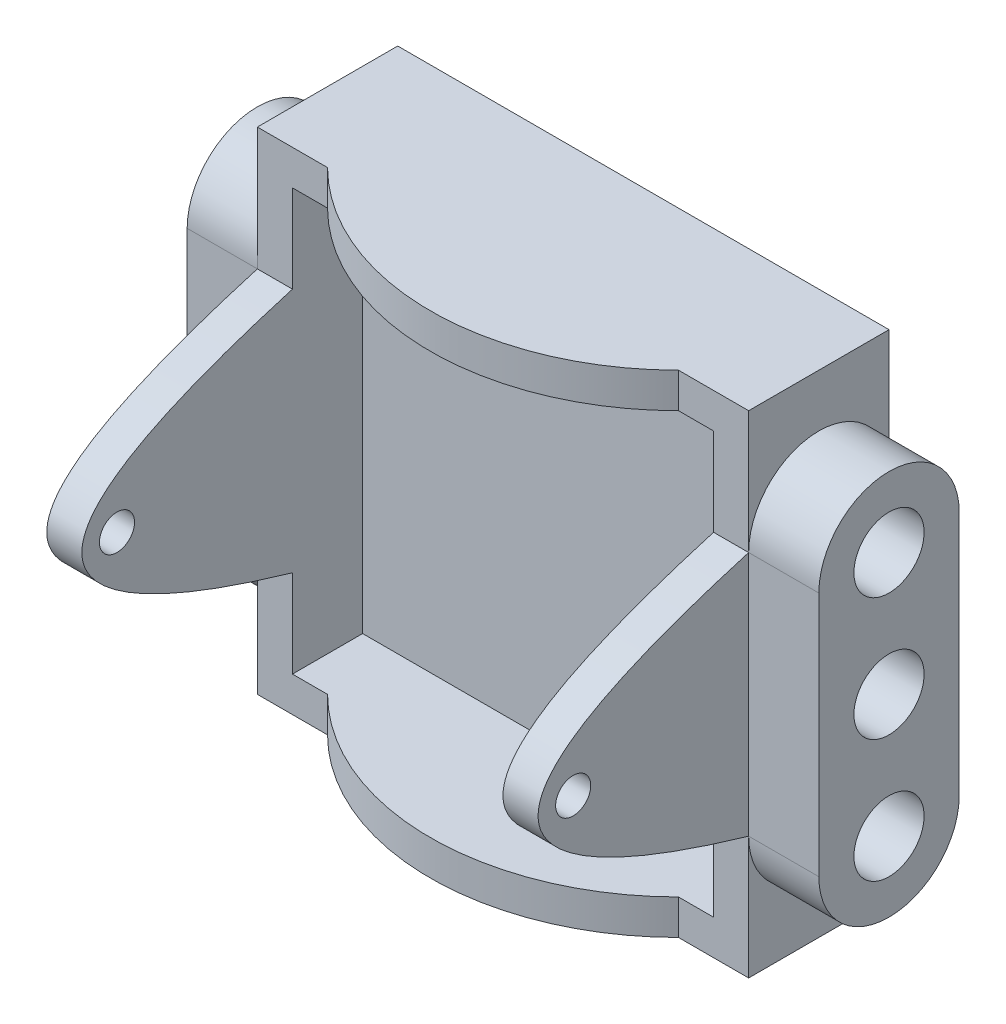
ISO-10303-21;
HEADER;
FILE_DESCRIPTION(('STEP AP214'),'2;1');
FILE_NAME('part.step','',(''),(''),'','','');
FILE_SCHEMA(('AUTOMOTIVE_DESIGN { 1 0 10303 214 1 1 1 1 }'));
ENDSEC;
DATA;
#1=APPLICATION_CONTEXT('core data for automotive mechanical design processes');
#2=APPLICATION_PROTOCOL_DEFINITION('international standard','automotive_design',2000,#1);
#3=PRODUCT_CONTEXT('',#1,'mechanical');
#4=PRODUCT('Part','Part','',(#3));
#5=PRODUCT_RELATED_PRODUCT_CATEGORY('part','',(#4));
#6=PRODUCT_DEFINITION_FORMATION('','',#4);
#7=PRODUCT_DEFINITION_CONTEXT('part definition',#1,'design');
#8=PRODUCT_DEFINITION('design','',#6,#7);
#9=PRODUCT_DEFINITION_SHAPE('','',#8);
#10=(LENGTH_UNIT() NAMED_UNIT(*) SI_UNIT(.MILLI.,.METRE.));
#11=(NAMED_UNIT(*) PLANE_ANGLE_UNIT() SI_UNIT($,.RADIAN.));
#12=(NAMED_UNIT(*) SI_UNIT($,.STERADIAN.) SOLID_ANGLE_UNIT());
#13=UNCERTAINTY_MEASURE_WITH_UNIT(LENGTH_MEASURE(1.E-05),#10,'distance_accuracy_value','');
#14=(GEOMETRIC_REPRESENTATION_CONTEXT(3) GLOBAL_UNCERTAINTY_ASSIGNED_CONTEXT((#13)) GLOBAL_UNIT_ASSIGNED_CONTEXT((#10,
#11,#12)) REPRESENTATION_CONTEXT('',''));
#15=CARTESIAN_POINT('',(0.,0.,0.));
#16=DIRECTION('',(0.,0.,1.));
#17=DIRECTION('',(1.,0.,0.));
#18=AXIS2_PLACEMENT_3D('',#15,#16,#17);
#19=CARTESIAN_POINT('',(9.525,-9.525,3.175));
#20=DIRECTION('',(1.,0.,0.));
#21=DIRECTION('',(0.,0.,-1.));
#22=AXIS2_PLACEMENT_3D('',#19,#20,#21);
#23=PLANE('',#22);
#24=CARTESIAN_POINT('',(9.525,-5.55625,6.35));
#25=CARTESIAN_POINT('',(9.525,0.,25.4));
#26=CARTESIAN_POINT('',(9.525,5.55625,6.35));
#27=B_SPLINE_CURVE_WITH_KNOTS('',2,(#24,#25,#26),.UNSPECIFIED.,.F.,.F.,(3,3),(0.,1.),.UNSPECIFIED.);
#28=CARTESIAN_POINT('',(9.525,5.55625,6.34999999999999));
#29=VERTEX_POINT('',#28);
#30=CARTESIAN_POINT('',(9.525,-5.55625,6.35));
#31=VERTEX_POINT('',#30);
#32=EDGE_CURVE('E509',#29,#31,#27,.F.);
#33=ORIENTED_EDGE('',*,*,#32,.F.);
#34=DIRECTION('',(0.,-1.,0.));
#35=VECTOR('',#34,1.);
#36=CARTESIAN_POINT('',(9.525,0.,6.34999999999999));
#37=LINE('',#36,#35);
#38=CARTESIAN_POINT('',(9.525,9.525,6.35));
#39=VERTEX_POINT('',#38);
#40=EDGE_CURVE('E501',#39,#29,#37,.T.);
#41=ORIENTED_EDGE('',*,*,#40,.F.);
#42=DIRECTION('',(0.,0.,1.));
#43=VECTOR('',#42,1.);
#44=CARTESIAN_POINT('',(9.525,9.525,3.175));
#45=LINE('',#44,#43);
#46=CARTESIAN_POINT('',(9.525,9.525,3.175));
#47=VERTEX_POINT('',#46);
#48=EDGE_CURVE('E506',#47,#39,#45,.T.);
#49=ORIENTED_EDGE('',*,*,#48,.F.);
#50=DIRECTION('',(0.,1.,0.));
#51=VECTOR('',#50,1.);
#52=CARTESIAN_POINT('',(9.525,-9.525,3.175));
#53=LINE('',#52,#51);
#54=CARTESIAN_POINT('',(9.525,-9.525,3.175));
#55=VERTEX_POINT('',#54);
#56=EDGE_CURVE('E576',#55,#47,#53,.T.);
#57=ORIENTED_EDGE('',*,*,#56,.F.);
#58=DIRECTION('',(0.,0.,1.));
#59=VECTOR('',#58,1.);
#60=CARTESIAN_POINT('',(9.525,-9.525,3.175));
#61=LINE('',#60,#59);
#62=CARTESIAN_POINT('',(9.525,-9.525,6.35));
#63=VERTEX_POINT('',#62);
#64=EDGE_CURVE('E546',#55,#63,#61,.T.);
#65=ORIENTED_EDGE('',*,*,#64,.T.);
#66=DIRECTION('',(0.,1.,0.));
#67=VECTOR('',#66,1.);
#68=CARTESIAN_POINT('',(9.525,0.,6.35));
#69=LINE('',#68,#67);
#70=EDGE_CURVE('E594',#63,#31,#69,.T.);
#71=ORIENTED_EDGE('',*,*,#70,.T.);
#72=EDGE_LOOP('',(#33,#41,#49,#57,#65,#71));
#73=FACE_BOUND('',#72,.T.);
#74=CARTESIAN_POINT('',(9.525,0.,14.2875));
#75=DIRECTION('',(1.,0.,0.));
#76=DIRECTION('',(0.,0.,-1.));
#77=AXIS2_PLACEMENT_3D('',#74,#75,#76);
#78=CIRCLE('',#77,0.793749999999999);
#79=CARTESIAN_POINT('',(9.525,0.,13.49375));
#80=VERTEX_POINT('',#79);
#81=EDGE_CURVE('E932',#80,#80,#78,.T.);
#82=ORIENTED_EDGE('',*,*,#81,.T.);
#83=EDGE_LOOP('',(#82));
#84=FACE_BOUND('',#83,.T.);
#85=ADVANCED_FACE('F351',(#73,#84),#23,.F.);
#86=CARTESIAN_POINT('',(11.1125,0.,0.));
#87=DIRECTION('',(1.,0.,0.));
#88=DIRECTION('',(0.,0.,1.));
#89=AXIS2_PLACEMENT_3D('',#86,#87,#88);
#90=PLANE('',#89);
#91=DIRECTION('',(0.,1.,0.));
#92=VECTOR('',#91,1.);
#93=CARTESIAN_POINT('',(11.1125,0.,6.35));
#94=LINE('',#93,#92);
#95=CARTESIAN_POINT('',(11.1125,-5.55625,6.35));
#96=VERTEX_POINT('',#95);
#97=CARTESIAN_POINT('',(11.1125,5.55625,6.35));
#98=VERTEX_POINT('',#97);
#99=EDGE_CURVE('E733',#96,#98,#94,.T.);
#100=ORIENTED_EDGE('',*,*,#99,.T.);
#101=CARTESIAN_POINT('',(11.1125,-5.55625,6.35));
#102=CARTESIAN_POINT('',(11.1125,0.,25.4));
#103=CARTESIAN_POINT('',(11.1125,5.55625,6.35));
#104=B_SPLINE_CURVE_WITH_KNOTS('',2,(#101,#102,#103),.UNSPECIFIED.,.F.,.F.,(3,3),(0.,1.),.UNSPECIFIED.);
#105=EDGE_CURVE('E602',#96,#98,#104,.T.);
#106=ORIENTED_EDGE('',*,*,#105,.F.);
#107=EDGE_LOOP('',(#100,#106));
#108=FACE_BOUND('',#107,.T.);
#109=CARTESIAN_POINT('',(11.1125,0.,14.2875));
#110=DIRECTION('',(-1.,0.,0.));
#111=DIRECTION('',(0.,0.,1.));
#112=AXIS2_PLACEMENT_3D('',#109,#110,#111);
#113=CIRCLE('',#112,0.793749999999999);
#114=CARTESIAN_POINT('',(11.1125,0.,15.08125));
#115=VERTEX_POINT('',#114);
#116=EDGE_CURVE('E515',#115,#115,#113,.T.);
#117=ORIENTED_EDGE('',*,*,#116,.T.);
#118=EDGE_LOOP('',(#117));
#119=FACE_BOUND('',#118,.T.);
#120=ADVANCED_FACE('F922',(#108,#119),#90,.T.);
#121=CARTESIAN_POINT('',(-14.2875,-11.1125,15.875));
#122=DIRECTION('',(0.,1.,0.));
#123=DIRECTION('',(0.,0.,1.));
#124=AXIS2_PLACEMENT_3D('',#121,#122,#123);
#125=PLANE('',#124);
#126=DIRECTION('',(0.,0.,1.));
#127=VECTOR('',#126,1.);
#128=CARTESIAN_POINT('',(11.1125,-11.1125,0.));
#129=LINE('',#128,#127);
#130=CARTESIAN_POINT('',(11.1125,-11.1125,0.));
#131=VERTEX_POINT('',#130);
#132=CARTESIAN_POINT('',(11.1125,-11.1125,6.35));
#133=VERTEX_POINT('',#132);
#134=EDGE_CURVE('E725',#131,#133,#129,.T.);
#135=ORIENTED_EDGE('',*,*,#134,.T.);
#136=DIRECTION('',(-1.,0.,0.));
#137=VECTOR('',#136,1.);
#138=CARTESIAN_POINT('',(0.,-11.1125,6.35));
#139=LINE('',#138,#137);
#140=CARTESIAN_POINT('',(7.9375,-11.1125,6.35));
#141=VERTEX_POINT('',#140);
#142=EDGE_CURVE('E659',#133,#141,#139,.T.);
#143=ORIENTED_EDGE('',*,*,#142,.T.);
#144=CARTESIAN_POINT('',(0.,-11.1125,-1.58749999999998));
#145=DIRECTION('',(0.,1.,0.));
#146=DIRECTION('',(0.,0.,1.));
#147=AXIS2_PLACEMENT_3D('',#144,#145,#146);
#148=CIRCLE('',#147,11.2253201513364);
#149=CARTESIAN_POINT('',(-7.9375,-11.1125,6.35));
#150=VERTEX_POINT('',#149);
#151=EDGE_CURVE('E649',#150,#141,#148,.T.);
#152=ORIENTED_EDGE('',*,*,#151,.F.);
#153=DIRECTION('',(1.,0.,0.));
#154=VECTOR('',#153,1.);
#155=CARTESIAN_POINT('',(0.,-11.1125,6.35));
#156=LINE('',#155,#154);
#157=CARTESIAN_POINT('',(-11.1125,-11.1125,6.35));
#158=VERTEX_POINT('',#157);
#159=EDGE_CURVE('E655',#158,#150,#156,.T.);
#160=ORIENTED_EDGE('',*,*,#159,.F.);
#161=DIRECTION('',(0.,0.,1.));
#162=VECTOR('',#161,1.);
#163=CARTESIAN_POINT('',(-11.1125,-11.1125,0.));
#164=LINE('',#163,#162);
#165=CARTESIAN_POINT('',(-11.1125,-11.1125,0.));
#166=VERTEX_POINT('',#165);
#167=EDGE_CURVE('E799',#166,#158,#164,.T.);
#168=ORIENTED_EDGE('',*,*,#167,.F.);
#169=DIRECTION('',(1.,0.,0.));
#170=VECTOR('',#169,1.);
#171=CARTESIAN_POINT('',(-14.2875,-11.1125,0.));
#172=LINE('',#171,#170);
#173=EDGE_CURVE('E554',#166,#131,#172,.T.);
#174=ORIENTED_EDGE('',*,*,#173,.T.);
#175=EDGE_LOOP('',(#135,#143,#152,#160,#168,#174));
#176=FACE_BOUND('',#175,.T.);
#177=ADVANCED_FACE('F925',(#176),#125,.F.);
#178=CARTESIAN_POINT('',(11.1125,-5.55625,3.175));
#179=DIRECTION('',(-1.,0.,0.));
#180=DIRECTION('',(0.,0.,1.));
#181=AXIS2_PLACEMENT_3D('',#178,#179,#180);
#182=CIRCLE('',#181,3.175);
#183=CARTESIAN_POINT('',(11.1125,-5.55625,0.));
#184=VERTEX_POINT('',#183);
#185=EDGE_CURVE('E729',#184,#96,#182,.T.);
#186=ORIENTED_EDGE('',*,*,#185,.T.);
#187=DIRECTION('',(0.,-1.,0.));
#188=VECTOR('',#187,1.);
#189=CARTESIAN_POINT('',(11.1125,0.,6.35));
#190=LINE('',#189,#188);
#191=EDGE_CURVE('E898',#96,#133,#190,.T.);
#192=ORIENTED_EDGE('',*,*,#191,.T.);
#193=ORIENTED_EDGE('',*,*,#134,.F.);
#194=DIRECTION('',(0.,-1.,0.));
#195=VECTOR('',#194,1.);
#196=CARTESIAN_POINT('',(11.1125,0.,0.));
#197=LINE('',#196,#195);
#198=EDGE_CURVE('E722',#184,#131,#197,.T.);
#199=ORIENTED_EDGE('',*,*,#198,.F.);
#200=EDGE_LOOP('',(#186,#192,#193,#199));
#201=FACE_BOUND('',#200,.T.);
#202=ADVANCED_FACE('F927',(#201),#90,.T.);
#203=CARTESIAN_POINT('',(-9.525,-9.525,3.175));
#204=DIRECTION('',(-1.,0.,0.));
#205=DIRECTION('',(0.,0.,1.));
#206=AXIS2_PLACEMENT_3D('',#203,#204,#205);
#207=PLANE('',#206);
#208=CARTESIAN_POINT('',(-9.525,0.,14.2875));
#209=DIRECTION('',(-1.,0.,0.));
#210=DIRECTION('',(0.,0.,1.));
#211=AXIS2_PLACEMENT_3D('',#208,#209,#210);
#212=CIRCLE('',#211,0.793749999999999);
#213=CARTESIAN_POINT('',(-9.525,0.,15.08125));
#214=VERTEX_POINT('',#213);
#215=EDGE_CURVE('E889',#214,#214,#212,.F.);
#216=ORIENTED_EDGE('',*,*,#215,.F.);
#217=EDGE_LOOP('',(#216));
#218=FACE_BOUND('',#217,.T.);
#219=CARTESIAN_POINT('',(-9.525,-5.55625,6.35));
#220=CARTESIAN_POINT('',(-9.525,0.,25.4));
#221=CARTESIAN_POINT('',(-9.525,5.55625,6.35));
#222=B_SPLINE_CURVE_WITH_KNOTS('',2,(#219,#220,#221),.UNSPECIFIED.,.F.,.F.,(3,3),(0.,1.),.UNSPECIFIED.);
#223=CARTESIAN_POINT('',(-9.525,5.55625,6.35));
#224=VERTEX_POINT('',#223);
#225=CARTESIAN_POINT('',(-9.525,-5.55625,6.35));
#226=VERTEX_POINT('',#225);
#227=EDGE_CURVE('E859',#224,#226,#222,.F.);
#228=ORIENTED_EDGE('',*,*,#227,.T.);
#229=DIRECTION('',(0.,1.,0.));
#230=VECTOR('',#229,1.);
#231=CARTESIAN_POINT('',(-9.52499999999999,-11.1125,6.35));
#232=LINE('',#231,#230);
#233=CARTESIAN_POINT('',(-9.52499999999999,-9.525,6.35));
#234=VERTEX_POINT('',#233);
#235=EDGE_CURVE('E882',#234,#226,#232,.T.);
#236=ORIENTED_EDGE('',*,*,#235,.F.);
#237=DIRECTION('',(0.,0.,1.));
#238=VECTOR('',#237,1.);
#239=CARTESIAN_POINT('',(-9.525,-9.525,3.175));
#240=LINE('',#239,#238);
#241=CARTESIAN_POINT('',(-9.525,-9.525,3.175));
#242=VERTEX_POINT('',#241);
#243=EDGE_CURVE('E534',#242,#234,#240,.T.);
#244=ORIENTED_EDGE('',*,*,#243,.F.);
#245=DIRECTION('',(0.,-1.,0.));
#246=VECTOR('',#245,1.);
#247=CARTESIAN_POINT('',(-9.525,-9.525,3.175));
#248=LINE('',#247,#246);
#249=CARTESIAN_POINT('',(-9.525,9.525,3.175));
#250=VERTEX_POINT('',#249);
#251=EDGE_CURVE('E537',#250,#242,#248,.T.);
#252=ORIENTED_EDGE('',*,*,#251,.F.);
#253=DIRECTION('',(0.,0.,1.));
#254=VECTOR('',#253,1.);
#255=CARTESIAN_POINT('',(-9.525,9.525,3.175));
#256=LINE('',#255,#254);
#257=CARTESIAN_POINT('',(-9.525,9.525,6.35));
#258=VERTEX_POINT('',#257);
#259=EDGE_CURVE('E528',#250,#258,#256,.T.);
#260=ORIENTED_EDGE('',*,*,#259,.T.);
#261=DIRECTION('',(0.,-1.,0.));
#262=VECTOR('',#261,1.);
#263=CARTESIAN_POINT('',(-9.525,0.,6.34999999999999));
#264=LINE('',#263,#262);
#265=EDGE_CURVE('E375',#258,#224,#264,.T.);
#266=ORIENTED_EDGE('',*,*,#265,.T.);
#267=EDGE_LOOP('',(#228,#236,#244,#252,#260,#266));
#268=FACE_BOUND('',#267,.T.);
#269=ADVANCED_FACE('F568',(#218,#268),#207,.F.);
#270=CARTESIAN_POINT('',(-11.1125,0.,0.));
#271=DIRECTION('',(-1.,0.,0.));
#272=DIRECTION('',(0.,0.,1.));
#273=AXIS2_PLACEMENT_3D('',#270,#271,#272);
#274=PLANE('',#273);
#275=CARTESIAN_POINT('',(-11.1125,0.,14.2875));
#276=DIRECTION('',(-1.,0.,0.));
#277=DIRECTION('',(0.,0.,1.));
#278=AXIS2_PLACEMENT_3D('',#275,#276,#277);
#279=CIRCLE('',#278,0.793749999999999);
#280=CARTESIAN_POINT('',(-11.1125,0.,15.08125));
#281=VERTEX_POINT('',#280);
#282=EDGE_CURVE('E886',#281,#281,#279,.T.);
#283=ORIENTED_EDGE('',*,*,#282,.F.);
#284=EDGE_LOOP('',(#283));
#285=FACE_BOUND('',#284,.T.);
#286=DIRECTION('',(0.,1.,0.));
#287=VECTOR('',#286,1.);
#288=CARTESIAN_POINT('',(-11.1125,0.,6.35));
#289=LINE('',#288,#287);
#290=CARTESIAN_POINT('',(-11.1125,-5.55625,6.35));
#291=VERTEX_POINT('',#290);
#292=CARTESIAN_POINT('',(-11.1125,5.55625,6.35));
#293=VERTEX_POINT('',#292);
#294=EDGE_CURVE('E787',#291,#293,#289,.T.);
#295=ORIENTED_EDGE('',*,*,#294,.F.);
#296=CARTESIAN_POINT('',(-11.1125,-5.55625,6.35));
#297=CARTESIAN_POINT('',(-11.1125,0.,25.4));
#298=CARTESIAN_POINT('',(-11.1125,5.55625,6.35));
#299=B_SPLINE_CURVE_WITH_KNOTS('',2,(#296,#297,#298),.UNSPECIFIED.,.F.,.F.,(3,3),(0.,1.),.UNSPECIFIED.);
#300=EDGE_CURVE('E855',#291,#293,#299,.T.);
#301=ORIENTED_EDGE('',*,*,#300,.T.);
#302=EDGE_LOOP('',(#295,#301));
#303=FACE_BOUND('',#302,.T.);
#304=ADVANCED_FACE('F854',(#285,#303),#274,.T.);
#305=CARTESIAN_POINT('',(-14.2875,11.1125,15.875));
#306=DIRECTION('',(0.,-1.,0.));
#307=DIRECTION('',(0.,0.,-1.));
#308=AXIS2_PLACEMENT_3D('',#305,#306,#307);
#309=PLANE('',#308);
#310=DIRECTION('',(-1.,0.,0.));
#311=VECTOR('',#310,1.);
#312=CARTESIAN_POINT('',(0.,11.1125,6.35));
#313=LINE('',#312,#311);
#314=CARTESIAN_POINT('',(11.1125,11.1125,6.35));
#315=VERTEX_POINT('',#314);
#316=CARTESIAN_POINT('',(7.9375,11.1125,6.35));
#317=VERTEX_POINT('',#316);
#318=EDGE_CURVE('E656',#315,#317,#313,.T.);
#319=ORIENTED_EDGE('',*,*,#318,.F.);
#320=DIRECTION('',(0.,0.,-1.));
#321=VECTOR('',#320,1.);
#322=CARTESIAN_POINT('',(11.1125,11.1125,0.));
#323=LINE('',#322,#321);
#324=CARTESIAN_POINT('',(11.1125,11.1125,0.));
#325=VERTEX_POINT('',#324);
#326=EDGE_CURVE('E721',#315,#325,#323,.T.);
#327=ORIENTED_EDGE('',*,*,#326,.T.);
#328=DIRECTION('',(-1.,0.,0.));
#329=VECTOR('',#328,1.);
#330=CARTESIAN_POINT('',(-14.2875,11.1125,0.));
#331=LINE('',#330,#329);
#332=CARTESIAN_POINT('',(-11.1125,11.1125,0.));
#333=VERTEX_POINT('',#332);
#334=EDGE_CURVE('E545',#325,#333,#331,.T.);
#335=ORIENTED_EDGE('',*,*,#334,.T.);
#336=DIRECTION('',(0.,0.,-1.));
#337=VECTOR('',#336,1.);
#338=CARTESIAN_POINT('',(-11.1125,11.1125,0.));
#339=LINE('',#338,#337);
#340=CARTESIAN_POINT('',(-11.1125,11.1125,6.35));
#341=VERTEX_POINT('',#340);
#342=EDGE_CURVE('E804',#341,#333,#339,.T.);
#343=ORIENTED_EDGE('',*,*,#342,.F.);
#344=DIRECTION('',(1.,0.,0.));
#345=VECTOR('',#344,1.);
#346=CARTESIAN_POINT('',(0.,11.1125,6.35));
#347=LINE('',#346,#345);
#348=CARTESIAN_POINT('',(-7.9375,11.1125,6.35));
#349=VERTEX_POINT('',#348);
#350=EDGE_CURVE('E667',#341,#349,#347,.T.);
#351=ORIENTED_EDGE('',*,*,#350,.T.);
#352=CARTESIAN_POINT('',(0.,11.1125,-1.58749999999998));
#353=DIRECTION('',(0.,1.,0.));
#354=DIRECTION('',(0.,0.,1.));
#355=AXIS2_PLACEMENT_3D('',#352,#353,#354);
#356=CIRCLE('',#355,11.2253201513364);
#357=EDGE_CURVE('E663',#349,#317,#356,.T.);
#358=ORIENTED_EDGE('',*,*,#357,.T.);
#359=EDGE_LOOP('',(#319,#327,#335,#343,#351,#358));
#360=FACE_BOUND('',#359,.T.);
#361=ADVANCED_FACE('F956',(#360),#309,.F.);
#362=DIRECTION('',(0.,-1.,0.));
#363=VECTOR('',#362,1.);
#364=CARTESIAN_POINT('',(-11.1125,0.,6.35));
#365=LINE('',#364,#363);
#366=EDGE_CURVE('E878',#291,#158,#365,.T.);
#367=ORIENTED_EDGE('',*,*,#366,.F.);
#368=CARTESIAN_POINT('',(-11.1125,-5.55625,3.175));
#369=DIRECTION('',(-1.,0.,0.));
#370=DIRECTION('',(0.,0.,1.));
#371=AXIS2_PLACEMENT_3D('',#368,#369,#370);
#372=CIRCLE('',#371,3.175);
#373=CARTESIAN_POINT('',(-11.1125,-5.55625,0.));
#374=VERTEX_POINT('',#373);
#375=EDGE_CURVE('E792',#374,#291,#372,.T.);
#376=ORIENTED_EDGE('',*,*,#375,.F.);
#377=DIRECTION('',(0.,-1.,0.));
#378=VECTOR('',#377,1.);
#379=CARTESIAN_POINT('',(-11.1125,0.,0.));
#380=LINE('',#379,#378);
#381=EDGE_CURVE('E796',#374,#166,#380,.T.);
#382=ORIENTED_EDGE('',*,*,#381,.T.);
#383=ORIENTED_EDGE('',*,*,#167,.T.);
#384=EDGE_LOOP('',(#367,#376,#382,#383));
#385=FACE_BOUND('',#384,.T.);
#386=ADVANCED_FACE('F958',(#385),#274,.T.);
#387=CARTESIAN_POINT('',(-11.1125,5.55625,3.175));
#388=DIRECTION('',(-1.,0.,0.));
#389=DIRECTION('',(0.,0.,1.));
#390=AXIS2_PLACEMENT_3D('',#387,#388,#389);
#391=CIRCLE('',#390,3.175);
#392=CARTESIAN_POINT('',(-11.1125,5.55625,0.));
#393=VERTEX_POINT('',#392);
#394=EDGE_CURVE('E784',#293,#393,#391,.T.);
#395=ORIENTED_EDGE('',*,*,#394,.F.);
#396=DIRECTION('',(0.,1.,0.));
#397=VECTOR('',#396,1.);
#398=CARTESIAN_POINT('',(-11.1125,0.,6.34999999999999));
#399=LINE('',#398,#397);
#400=EDGE_CURVE('E668',#293,#341,#399,.T.);
#401=ORIENTED_EDGE('',*,*,#400,.T.);
#402=ORIENTED_EDGE('',*,*,#342,.T.);
#403=EDGE_CURVE('E800',#333,#393,#380,.T.);
#404=ORIENTED_EDGE('',*,*,#403,.T.);
#405=EDGE_LOOP('',(#395,#401,#402,#404));
#406=FACE_BOUND('',#405,.T.);
#407=ADVANCED_FACE('F837',(#406),#274,.T.);
#408=CARTESIAN_POINT('',(0.,0.,0.));
#409=DIRECTION('',(0.,0.,-1.));
#410=DIRECTION('',(-1.,0.,0.));
#411=AXIS2_PLACEMENT_3D('',#408,#409,#410);
#412=PLANE('',#411);
#413=DIRECTION('',(1.,0.,0.));
#414=VECTOR('',#413,1.);
#415=CARTESIAN_POINT('',(11.1125,5.55625,0.));
#416=LINE('',#415,#414);
#417=CARTESIAN_POINT('',(11.1125,5.55625,0.));
#418=VERTEX_POINT('',#417);
#419=CARTESIAN_POINT('',(14.2875,5.55625,0.));
#420=VERTEX_POINT('',#419);
#421=EDGE_CURVE('E737',#418,#420,#416,.T.);
#422=ORIENTED_EDGE('',*,*,#421,.T.);
#423=DIRECTION('',(0.,1.,0.));
#424=VECTOR('',#423,1.);
#425=CARTESIAN_POINT('',(14.2875,-11.1125,0.));
#426=LINE('',#425,#424);
#427=CARTESIAN_POINT('',(14.2875,-5.55625,0.));
#428=VERTEX_POINT('',#427);
#429=EDGE_CURVE('E541',#428,#420,#426,.T.);
#430=ORIENTED_EDGE('',*,*,#429,.F.);
#431=DIRECTION('',(1.,0.,0.));
#432=VECTOR('',#431,1.);
#433=CARTESIAN_POINT('',(11.1125,-5.55625,0.));
#434=LINE('',#433,#432);
#435=EDGE_CURVE('E754',#184,#428,#434,.T.);
#436=ORIENTED_EDGE('',*,*,#435,.F.);
#437=ORIENTED_EDGE('',*,*,#198,.T.);
#438=ORIENTED_EDGE('',*,*,#173,.F.);
#439=ORIENTED_EDGE('',*,*,#381,.F.);
#440=DIRECTION('',(-1.,0.,0.));
#441=VECTOR('',#440,1.);
#442=CARTESIAN_POINT('',(-11.1125,-5.55625,0.));
#443=LINE('',#442,#441);
#444=CARTESIAN_POINT('',(-14.2875,-5.55625,0.));
#445=VERTEX_POINT('',#444);
#446=EDGE_CURVE('E819',#374,#445,#443,.T.);
#447=ORIENTED_EDGE('',*,*,#446,.T.);
#448=DIRECTION('',(0.,-1.,0.));
#449=VECTOR('',#448,1.);
#450=CARTESIAN_POINT('',(-14.2875,-11.1125,0.));
#451=LINE('',#450,#449);
#452=CARTESIAN_POINT('',(-14.2875,5.55625,0.));
#453=VERTEX_POINT('',#452);
#454=EDGE_CURVE('E550',#453,#445,#451,.T.);
#455=ORIENTED_EDGE('',*,*,#454,.F.);
#456=DIRECTION('',(-1.,0.,0.));
#457=VECTOR('',#456,1.);
#458=CARTESIAN_POINT('',(-11.1125,5.55625,0.));
#459=LINE('',#458,#457);
#460=EDGE_CURVE('E580',#393,#453,#459,.T.);
#461=ORIENTED_EDGE('',*,*,#460,.F.);
#462=ORIENTED_EDGE('',*,*,#403,.F.);
#463=ORIENTED_EDGE('',*,*,#334,.F.);
#464=EDGE_CURVE('E716',#325,#418,#197,.T.);
#465=ORIENTED_EDGE('',*,*,#464,.T.);
#466=EDGE_LOOP('',(#422,#430,#436,#437,#438,#439,#447,#455,#461,#462,#463,#465));
#467=FACE_BOUND('',#466,.T.);
#468=ADVANCED_FACE('F843',(#467),#412,.T.);
#469=CARTESIAN_POINT('',(14.2875,-11.1125,15.875));
#470=DIRECTION('',(-1.,0.,0.));
#471=DIRECTION('',(0.,0.,1.));
#472=AXIS2_PLACEMENT_3D('',#469,#470,#471);
#473=PLANE('',#472);
#474=ORIENTED_EDGE('',*,*,#429,.T.);
#475=CARTESIAN_POINT('',(14.2875,5.55625,3.175));
#476=DIRECTION('',(-1.,0.,0.));
#477=DIRECTION('',(0.,0.,1.));
#478=AXIS2_PLACEMENT_3D('',#475,#476,#477);
#479=CIRCLE('',#478,3.175);
#480=CARTESIAN_POINT('',(14.2875,5.55625,6.35));
#481=VERTEX_POINT('',#480);
#482=EDGE_CURVE('E692',#481,#420,#479,.T.);
#483=ORIENTED_EDGE('',*,*,#482,.F.);
#484=DIRECTION('',(0.,1.,0.));
#485=VECTOR('',#484,1.);
#486=CARTESIAN_POINT('',(14.2875,0.,6.35));
#487=LINE('',#486,#485);
#488=CARTESIAN_POINT('',(14.2875,-5.55625,6.35));
#489=VERTEX_POINT('',#488);
#490=EDGE_CURVE('E717',#489,#481,#487,.T.);
#491=ORIENTED_EDGE('',*,*,#490,.F.);
#492=CARTESIAN_POINT('',(14.2875,-5.55625,3.175));
#493=DIRECTION('',(-1.,0.,0.));
#494=DIRECTION('',(0.,0.,1.));
#495=AXIS2_PLACEMENT_3D('',#492,#493,#494);
#496=CIRCLE('',#495,3.175);
#497=EDGE_CURVE('E740',#428,#489,#496,.T.);
#498=ORIENTED_EDGE('',*,*,#497,.F.);
#499=EDGE_LOOP('',(#474,#483,#491,#498));
#500=FACE_BOUND('',#499,.T.);
#501=CARTESIAN_POINT('',(14.2875,5.55625,3.175));
#502=DIRECTION('',(-1.,0.,0.));
#503=DIRECTION('',(0.,0.,1.));
#504=AXIS2_PLACEMENT_3D('',#501,#502,#503);
#505=CIRCLE('',#504,1.5875);
#506=CARTESIAN_POINT('',(14.2875,5.55625,4.7625));
#507=VERTEX_POINT('',#506);
#508=EDGE_CURVE('E693',#507,#507,#505,.T.);
#509=ORIENTED_EDGE('',*,*,#508,.T.);
#510=EDGE_LOOP('',(#509));
#511=FACE_BOUND('',#510,.T.);
#512=CARTESIAN_POINT('',(14.2875,0.,3.175));
#513=DIRECTION('',(-1.,0.,0.));
#514=DIRECTION('',(0.,0.,1.));
#515=AXIS2_PLACEMENT_3D('',#512,#513,#514);
#516=CIRCLE('',#515,1.5875);
#517=CARTESIAN_POINT('',(14.2875,0.,4.7625));
#518=VERTEX_POINT('',#517);
#519=EDGE_CURVE('E701',#518,#518,#516,.T.);
#520=ORIENTED_EDGE('',*,*,#519,.T.);
#521=EDGE_LOOP('',(#520));
#522=FACE_BOUND('',#521,.T.);
#523=CARTESIAN_POINT('',(14.2875,-5.55625,3.175));
#524=DIRECTION('',(-1.,0.,0.));
#525=DIRECTION('',(0.,0.,1.));
#526=AXIS2_PLACEMENT_3D('',#523,#524,#525);
#527=CIRCLE('',#526,1.5875);
#528=CARTESIAN_POINT('',(14.2875,-5.55625,4.7625));
#529=VERTEX_POINT('',#528);
#530=EDGE_CURVE('E687',#529,#529,#527,.T.);
#531=ORIENTED_EDGE('',*,*,#530,.T.);
#532=EDGE_LOOP('',(#531));
#533=FACE_BOUND('',#532,.T.);
#534=ADVANCED_FACE('F353',(#500,#511,#522,#533),#473,.F.);
#535=CARTESIAN_POINT('',(-14.2875,-11.1125,15.875));
#536=DIRECTION('',(1.,0.,0.));
#537=DIRECTION('',(0.,0.,-1.));
#538=AXIS2_PLACEMENT_3D('',#535,#536,#537);
#539=PLANE('',#538);
#540=CARTESIAN_POINT('',(-14.2875,-5.55625,3.175));
#541=DIRECTION('',(-1.,0.,0.));
#542=DIRECTION('',(0.,0.,1.));
#543=AXIS2_PLACEMENT_3D('',#540,#541,#542);
#544=CIRCLE('',#543,1.5875);
#545=CARTESIAN_POINT('',(-14.2875,-5.55625,4.7625));
#546=VERTEX_POINT('',#545);
#547=EDGE_CURVE('E750',#546,#546,#544,.T.);
#548=ORIENTED_EDGE('',*,*,#547,.F.);
#549=EDGE_LOOP('',(#548));
#550=FACE_BOUND('',#549,.T.);
#551=CARTESIAN_POINT('',(-14.2875,0.,3.175));
#552=DIRECTION('',(-1.,0.,0.));
#553=DIRECTION('',(0.,0.,1.));
#554=AXIS2_PLACEMENT_3D('',#551,#552,#553);
#555=CIRCLE('',#554,1.5875);
#556=CARTESIAN_POINT('',(-14.2875,0.,4.7625));
#557=VERTEX_POINT('',#556);
#558=EDGE_CURVE('E773',#557,#557,#555,.T.);
#559=ORIENTED_EDGE('',*,*,#558,.F.);
#560=EDGE_LOOP('',(#559));
#561=FACE_BOUND('',#560,.T.);
#562=CARTESIAN_POINT('',(-14.2875,5.55625,3.175));
#563=DIRECTION('',(-1.,0.,0.));
#564=DIRECTION('',(0.,0.,1.));
#565=AXIS2_PLACEMENT_3D('',#562,#563,#564);
#566=CIRCLE('',#565,1.5875);
#567=CARTESIAN_POINT('',(-14.2875,5.55625,4.7625));
#568=VERTEX_POINT('',#567);
#569=EDGE_CURVE('E765',#568,#568,#566,.T.);
#570=ORIENTED_EDGE('',*,*,#569,.F.);
#571=EDGE_LOOP('',(#570));
#572=FACE_BOUND('',#571,.T.);
#573=CARTESIAN_POINT('',(-14.2875,5.55625,3.175));
#574=DIRECTION('',(-1.,0.,0.));
#575=DIRECTION('',(0.,0.,1.));
#576=AXIS2_PLACEMENT_3D('',#573,#574,#575);
#577=CIRCLE('',#576,3.175);
#578=CARTESIAN_POINT('',(-14.2875,5.55625,6.35));
#579=VERTEX_POINT('',#578);
#580=EDGE_CURVE('E764',#579,#453,#577,.T.);
#581=ORIENTED_EDGE('',*,*,#580,.T.);
#582=ORIENTED_EDGE('',*,*,#454,.T.);
#583=CARTESIAN_POINT('',(-14.2875,-5.55625,3.175));
#584=DIRECTION('',(-1.,0.,0.));
#585=DIRECTION('',(0.,0.,1.));
#586=AXIS2_PLACEMENT_3D('',#583,#584,#585);
#587=CIRCLE('',#586,3.175);
#588=CARTESIAN_POINT('',(-14.2875,-5.55625,6.35));
#589=VERTEX_POINT('',#588);
#590=EDGE_CURVE('E788',#445,#589,#587,.T.);
#591=ORIENTED_EDGE('',*,*,#590,.T.);
#592=DIRECTION('',(0.,1.,0.));
#593=VECTOR('',#592,1.);
#594=CARTESIAN_POINT('',(-14.2875,0.,6.35));
#595=LINE('',#594,#593);
#596=EDGE_CURVE('E810',#589,#579,#595,.T.);
#597=ORIENTED_EDGE('',*,*,#596,.T.);
#598=EDGE_LOOP('',(#581,#582,#591,#597));
#599=FACE_BOUND('',#598,.T.);
#600=ADVANCED_FACE('F847',(#550,#561,#572,#599),#539,.F.);
#601=CARTESIAN_POINT('',(-9.525,-9.525,3.175));
#602=DIRECTION('',(0.,-1.,0.));
#603=DIRECTION('',(0.,0.,-1.));
#604=AXIS2_PLACEMENT_3D('',#601,#602,#603);
#605=PLANE('',#604);
#606=CARTESIAN_POINT('',(0.,-9.525,-1.58749999999998));
#607=DIRECTION('',(0.,-1.,0.));
#608=DIRECTION('',(0.,0.,-1.));
#609=AXIS2_PLACEMENT_3D('',#606,#607,#608);
#610=CIRCLE('',#609,11.2253201513364);
#611=CARTESIAN_POINT('',(7.9375,-9.525,6.35));
#612=VERTEX_POINT('',#611);
#613=CARTESIAN_POINT('',(-7.9375,-9.525,6.35));
#614=VERTEX_POINT('',#613);
#615=EDGE_CURVE('E684',#612,#614,#610,.T.);
#616=ORIENTED_EDGE('',*,*,#615,.F.);
#617=DIRECTION('',(1.,0.,0.));
#618=VECTOR('',#617,1.);
#619=CARTESIAN_POINT('',(-9.525,-9.525,6.35));
#620=LINE('',#619,#618);
#621=EDGE_CURVE('E593',#612,#63,#620,.T.);
#622=ORIENTED_EDGE('',*,*,#621,.T.);
#623=ORIENTED_EDGE('',*,*,#64,.F.);
#624=DIRECTION('',(1.,0.,0.));
#625=VECTOR('',#624,1.);
#626=CARTESIAN_POINT('',(-9.525,-9.525,3.175));
#627=LINE('',#626,#625);
#628=EDGE_CURVE('E529',#242,#55,#627,.T.);
#629=ORIENTED_EDGE('',*,*,#628,.F.);
#630=ORIENTED_EDGE('',*,*,#243,.T.);
#631=DIRECTION('',(-1.,0.,0.));
#632=VECTOR('',#631,1.);
#633=CARTESIAN_POINT('',(-9.525,-9.525,6.35));
#634=LINE('',#633,#632);
#635=EDGE_CURVE('E591',#614,#234,#634,.T.);
#636=ORIENTED_EDGE('',*,*,#635,.F.);
#637=EDGE_LOOP('',(#616,#622,#623,#629,#630,#636));
#638=FACE_BOUND('',#637,.T.);
#639=ADVANCED_FACE('F590',(#638),#605,.F.);
#640=CARTESIAN_POINT('',(-9.525,9.525,3.175));
#641=DIRECTION('',(0.,1.,0.));
#642=DIRECTION('',(0.,0.,1.));
#643=AXIS2_PLACEMENT_3D('',#640,#641,#642);
#644=PLANE('',#643);
#645=ORIENTED_EDGE('',*,*,#48,.T.);
#646=DIRECTION('',(-1.,0.,0.));
#647=VECTOR('',#646,1.);
#648=CARTESIAN_POINT('',(-9.525,9.525,6.35));
#649=LINE('',#648,#647);
#650=CARTESIAN_POINT('',(7.9375,9.525,6.35));
#651=VERTEX_POINT('',#650);
#652=EDGE_CURVE('E12',#39,#651,#649,.T.);
#653=ORIENTED_EDGE('',*,*,#652,.T.);
#654=CARTESIAN_POINT('',(0.,9.525,-1.58749999999998));
#655=DIRECTION('',(0.,1.,0.));
#656=DIRECTION('',(0.,0.,1.));
#657=AXIS2_PLACEMENT_3D('',#654,#655,#656);
#658=CIRCLE('',#657,11.2253201513364);
#659=CARTESIAN_POINT('',(-7.9375,9.525,6.35));
#660=VERTEX_POINT('',#659);
#661=EDGE_CURVE('E360',#660,#651,#658,.T.);
#662=ORIENTED_EDGE('',*,*,#661,.F.);
#663=DIRECTION('',(1.,0.,0.));
#664=VECTOR('',#663,1.);
#665=CARTESIAN_POINT('',(-9.525,9.525,6.35));
#666=LINE('',#665,#664);
#667=EDGE_CURVE('E558',#258,#660,#666,.T.);
#668=ORIENTED_EDGE('',*,*,#667,.F.);
#669=ORIENTED_EDGE('',*,*,#259,.F.);
#670=DIRECTION('',(-1.,0.,0.));
#671=VECTOR('',#670,1.);
#672=CARTESIAN_POINT('',(-9.525,9.525,3.175));
#673=LINE('',#672,#671);
#674=EDGE_CURVE('E525',#47,#250,#673,.T.);
#675=ORIENTED_EDGE('',*,*,#674,.F.);
#676=EDGE_LOOP('',(#645,#653,#662,#668,#669,#675));
#677=FACE_BOUND('',#676,.T.);
#678=ADVANCED_FACE('F523',(#677),#644,.F.);
#679=CARTESIAN_POINT('',(0.,0.,3.175));
#680=DIRECTION('',(0.,0.,-1.));
#681=DIRECTION('',(-1.,0.,0.));
#682=AXIS2_PLACEMENT_3D('',#679,#680,#681);
#683=PLANE('',#682);
#684=ORIENTED_EDGE('',*,*,#56,.T.);
#685=ORIENTED_EDGE('',*,*,#674,.T.);
#686=ORIENTED_EDGE('',*,*,#251,.T.);
#687=ORIENTED_EDGE('',*,*,#628,.T.);
#688=EDGE_LOOP('',(#684,#685,#686,#687));
#689=FACE_BOUND('',#688,.T.);
#690=ADVANCED_FACE('F575',(#689),#683,.F.);
#691=CARTESIAN_POINT('',(-11.1125,5.55625,3.175));
#692=DIRECTION('',(-1.,0.,0.));
#693=DIRECTION('',(0.,0.,1.));
#694=AXIS2_PLACEMENT_3D('',#691,#692,#693);
#695=CYLINDRICAL_SURFACE('',#694,3.175);
#696=ORIENTED_EDGE('',*,*,#580,.F.);
#697=DIRECTION('',(-1.,0.,0.));
#698=VECTOR('',#697,1.);
#699=CARTESIAN_POINT('',(-11.1125,5.55625,6.35));
#700=LINE('',#699,#698);
#701=EDGE_CURVE('E825',#293,#579,#700,.T.);
#702=ORIENTED_EDGE('',*,*,#701,.F.);
#703=ORIENTED_EDGE('',*,*,#394,.T.);
#704=ORIENTED_EDGE('',*,*,#460,.T.);
#705=EDGE_LOOP('',(#696,#702,#703,#704));
#706=FACE_BOUND('',#705,.T.);
#707=ADVANCED_FACE('F845',(#706),#695,.T.);
#708=CARTESIAN_POINT('',(-11.1125,-5.55625,3.175));
#709=DIRECTION('',(-1.,0.,0.));
#710=DIRECTION('',(0.,0.,1.));
#711=AXIS2_PLACEMENT_3D('',#708,#709,#710);
#712=CYLINDRICAL_SURFACE('',#711,3.175);
#713=ORIENTED_EDGE('',*,*,#590,.F.);
#714=ORIENTED_EDGE('',*,*,#446,.F.);
#715=ORIENTED_EDGE('',*,*,#375,.T.);
#716=DIRECTION('',(-1.,0.,0.));
#717=VECTOR('',#716,1.);
#718=CARTESIAN_POINT('',(-11.1125,-5.55625,6.35));
#719=LINE('',#718,#717);
#720=EDGE_CURVE('E823',#291,#589,#719,.T.);
#721=ORIENTED_EDGE('',*,*,#720,.T.);
#722=EDGE_LOOP('',(#713,#714,#715,#721));
#723=FACE_BOUND('',#722,.T.);
#724=ADVANCED_FACE('F977',(#723),#712,.T.);
#725=CARTESIAN_POINT('',(-11.1125,0.,6.35));
#726=DIRECTION('',(0.,0.,1.));
#727=DIRECTION('',(0.,-1.,0.));
#728=AXIS2_PLACEMENT_3D('',#725,#726,#727);
#729=PLANE('',#728);
#730=ORIENTED_EDGE('',*,*,#596,.F.);
#731=ORIENTED_EDGE('',*,*,#720,.F.);
#732=ORIENTED_EDGE('',*,*,#294,.T.);
#733=ORIENTED_EDGE('',*,*,#701,.T.);
#734=EDGE_LOOP('',(#730,#731,#732,#733));
#735=FACE_BOUND('',#734,.T.);
#736=ADVANCED_FACE('F849',(#735),#729,.T.);
#737=CARTESIAN_POINT('',(-11.1125,5.55625,3.175));
#738=DIRECTION('',(-1.,0.,0.));
#739=DIRECTION('',(0.,0.,1.));
#740=AXIS2_PLACEMENT_3D('',#737,#738,#739);
#741=CYLINDRICAL_SURFACE('',#740,1.5875);
#742=CARTESIAN_POINT('',(-11.1125,5.55625,3.175));
#743=DIRECTION('',(-1.,0.,0.));
#744=DIRECTION('',(0.,0.,1.));
#745=AXIS2_PLACEMENT_3D('',#742,#743,#744);
#746=CIRCLE('',#745,1.5875);
#747=CARTESIAN_POINT('',(-11.1125,5.55625,4.7625));
#748=VERTEX_POINT('',#747);
#749=EDGE_CURVE('E760',#748,#748,#746,.T.);
#750=ORIENTED_EDGE('',*,*,#749,.F.);
#751=EDGE_LOOP('',(#750));
#752=FACE_BOUND('',#751,.T.);
#753=ORIENTED_EDGE('',*,*,#569,.T.);
#754=EDGE_LOOP('',(#753));
#755=FACE_BOUND('',#754,.T.);
#756=ADVANCED_FACE('F1030',(#752,#755),#741,.F.);
#757=CARTESIAN_POINT('',(-11.1125,0.,0.));
#758=DIRECTION('',(-1.,0.,0.));
#759=DIRECTION('',(0.,0.,1.));
#760=AXIS2_PLACEMENT_3D('',#757,#758,#759);
#761=PLANE('',#760);
#762=ORIENTED_EDGE('',*,*,#749,.T.);
#763=EDGE_LOOP('',(#762));
#764=FACE_BOUND('',#763,.T.);
#765=ADVANCED_FACE('F1026',(#764),#761,.T.);
#766=CARTESIAN_POINT('',(-11.1125,0.,3.175));
#767=DIRECTION('',(-1.,0.,0.));
#768=DIRECTION('',(0.,0.,1.));
#769=AXIS2_PLACEMENT_3D('',#766,#767,#768);
#770=CYLINDRICAL_SURFACE('',#769,1.5875);
#771=CARTESIAN_POINT('',(-11.1125,0.,3.175));
#772=DIRECTION('',(-1.,0.,0.));
#773=DIRECTION('',(0.,0.,1.));
#774=AXIS2_PLACEMENT_3D('',#771,#772,#773);
#775=CIRCLE('',#774,1.5875);
#776=CARTESIAN_POINT('',(-11.1125,0.,4.7625));
#777=VERTEX_POINT('',#776);
#778=EDGE_CURVE('E769',#777,#777,#775,.T.);
#779=ORIENTED_EDGE('',*,*,#778,.F.);
#780=EDGE_LOOP('',(#779));
#781=FACE_BOUND('',#780,.T.);
#782=ORIENTED_EDGE('',*,*,#558,.T.);
#783=EDGE_LOOP('',(#782));
#784=FACE_BOUND('',#783,.T.);
#785=ADVANCED_FACE('F1029',(#781,#784),#770,.F.);
#786=CARTESIAN_POINT('',(-11.1125,0.,0.));
#787=DIRECTION('',(-1.,0.,0.));
#788=DIRECTION('',(0.,0.,1.));
#789=AXIS2_PLACEMENT_3D('',#786,#787,#788);
#790=PLANE('',#789);
#791=ORIENTED_EDGE('',*,*,#778,.T.);
#792=EDGE_LOOP('',(#791));
#793=FACE_BOUND('',#792,.T.);
#794=ADVANCED_FACE('F1035',(#793),#790,.T.);
#795=CARTESIAN_POINT('',(-11.1125,-5.55625,3.175));
#796=DIRECTION('',(-1.,0.,0.));
#797=DIRECTION('',(0.,0.,1.));
#798=AXIS2_PLACEMENT_3D('',#795,#796,#797);
#799=CYLINDRICAL_SURFACE('',#798,1.5875);
#800=CARTESIAN_POINT('',(-11.1125,-5.55625,3.175));
#801=DIRECTION('',(-1.,0.,0.));
#802=DIRECTION('',(0.,0.,1.));
#803=AXIS2_PLACEMENT_3D('',#800,#801,#802);
#804=CIRCLE('',#803,1.5875);
#805=CARTESIAN_POINT('',(-11.1125,-5.55625,4.7625));
#806=VERTEX_POINT('',#805);
#807=EDGE_CURVE('E777',#806,#806,#804,.T.);
#808=ORIENTED_EDGE('',*,*,#807,.F.);
#809=EDGE_LOOP('',(#808));
#810=FACE_BOUND('',#809,.T.);
#811=ORIENTED_EDGE('',*,*,#547,.T.);
#812=EDGE_LOOP('',(#811));
#813=FACE_BOUND('',#812,.T.);
#814=ADVANCED_FACE('F1038',(#810,#813),#799,.F.);
#815=CARTESIAN_POINT('',(-11.1125,0.,0.));
#816=DIRECTION('',(-1.,0.,0.));
#817=DIRECTION('',(0.,0.,1.));
#818=AXIS2_PLACEMENT_3D('',#815,#816,#817);
#819=PLANE('',#818);
#820=ORIENTED_EDGE('',*,*,#807,.T.);
#821=EDGE_LOOP('',(#820));
#822=FACE_BOUND('',#821,.T.);
#823=ADVANCED_FACE('F1025',(#822),#819,.T.);
#824=CARTESIAN_POINT('',(11.1125,5.55625,3.175));
#825=DIRECTION('',(1.,0.,0.));
#826=DIRECTION('',(0.,0.,-1.));
#827=AXIS2_PLACEMENT_3D('',#824,#825,#826);
#828=CYLINDRICAL_SURFACE('',#827,3.175);
#829=ORIENTED_EDGE('',*,*,#482,.T.);
#830=ORIENTED_EDGE('',*,*,#421,.F.);
#831=CARTESIAN_POINT('',(11.1125,5.55625,3.175));
#832=DIRECTION('',(-1.,0.,0.));
#833=DIRECTION('',(0.,0.,1.));
#834=AXIS2_PLACEMENT_3D('',#831,#832,#833);
#835=CIRCLE('',#834,3.175);
#836=EDGE_CURVE('E712',#98,#418,#835,.T.);
#837=ORIENTED_EDGE('',*,*,#836,.F.);
#838=DIRECTION('',(1.,0.,0.));
#839=VECTOR('',#838,1.);
#840=CARTESIAN_POINT('',(11.1125,5.55625,6.35));
#841=LINE('',#840,#839);
#842=EDGE_CURVE('E747',#98,#481,#841,.T.);
#843=ORIENTED_EDGE('',*,*,#842,.T.);
#844=EDGE_LOOP('',(#829,#830,#837,#843));
#845=FACE_BOUND('',#844,.T.);
#846=ADVANCED_FACE('F921',(#845),#828,.T.);
#847=CARTESIAN_POINT('',(11.1125,0.,6.35));
#848=DIRECTION('',(0.,0.,-1.));
#849=DIRECTION('',(0.,1.,0.));
#850=AXIS2_PLACEMENT_3D('',#847,#848,#849);
#851=PLANE('',#850);
#852=ORIENTED_EDGE('',*,*,#490,.T.);
#853=ORIENTED_EDGE('',*,*,#842,.F.);
#854=ORIENTED_EDGE('',*,*,#99,.F.);
#855=DIRECTION('',(1.,0.,0.));
#856=VECTOR('',#855,1.);
#857=CARTESIAN_POINT('',(11.1125,-5.55625,6.35));
#858=LINE('',#857,#856);
#859=EDGE_CURVE('E751',#96,#489,#858,.T.);
#860=ORIENTED_EDGE('',*,*,#859,.T.);
#861=EDGE_LOOP('',(#852,#853,#854,#860));
#862=FACE_BOUND('',#861,.T.);
#863=ADVANCED_FACE('F917',(#862),#851,.F.);
#864=CARTESIAN_POINT('',(11.1125,-5.55625,3.175));
#865=DIRECTION('',(1.,0.,0.));
#866=DIRECTION('',(0.,0.,-1.));
#867=AXIS2_PLACEMENT_3D('',#864,#865,#866);
#868=CYLINDRICAL_SURFACE('',#867,3.175);
#869=ORIENTED_EDGE('',*,*,#497,.T.);
#870=ORIENTED_EDGE('',*,*,#859,.F.);
#871=ORIENTED_EDGE('',*,*,#185,.F.);
#872=ORIENTED_EDGE('',*,*,#435,.T.);
#873=EDGE_LOOP('',(#869,#870,#871,#872));
#874=FACE_BOUND('',#873,.T.);
#875=ADVANCED_FACE('F990',(#874),#868,.T.);
#876=DIRECTION('',(0.,1.,0.));
#877=VECTOR('',#876,1.);
#878=CARTESIAN_POINT('',(11.1125,0.,6.34999999999999));
#879=LINE('',#878,#877);
#880=EDGE_CURVE('E598',#98,#315,#879,.T.);
#881=ORIENTED_EDGE('',*,*,#880,.F.);
#882=ORIENTED_EDGE('',*,*,#836,.T.);
#883=ORIENTED_EDGE('',*,*,#464,.F.);
#884=ORIENTED_EDGE('',*,*,#326,.F.);
#885=EDGE_LOOP('',(#881,#882,#883,#884));
#886=FACE_BOUND('',#885,.T.);
#887=ADVANCED_FACE('F912',(#886),#90,.T.);
#888=CARTESIAN_POINT('',(11.1125,5.55625,3.175));
#889=DIRECTION('',(1.,0.,0.));
#890=DIRECTION('',(0.,0.,-1.));
#891=AXIS2_PLACEMENT_3D('',#888,#889,#890);
#892=CYLINDRICAL_SURFACE('',#891,1.5875);
#893=CARTESIAN_POINT('',(11.1125,5.55625,3.175));
#894=DIRECTION('',(-1.,0.,0.));
#895=DIRECTION('',(0.,0.,1.));
#896=AXIS2_PLACEMENT_3D('',#893,#894,#895);
#897=CIRCLE('',#896,1.5875);
#898=CARTESIAN_POINT('',(11.1125,5.55625,4.7625));
#899=VERTEX_POINT('',#898);
#900=EDGE_CURVE('E688',#899,#899,#897,.T.);
#901=ORIENTED_EDGE('',*,*,#900,.T.);
#902=EDGE_LOOP('',(#901));
#903=FACE_BOUND('',#902,.T.);
#904=ORIENTED_EDGE('',*,*,#508,.F.);
#905=EDGE_LOOP('',(#904));
#906=FACE_BOUND('',#905,.T.);
#907=ADVANCED_FACE('F1018',(#903,#906),#892,.F.);
#908=CARTESIAN_POINT('',(11.1125,0.,0.));
#909=DIRECTION('',(1.,0.,0.));
#910=DIRECTION('',(0.,0.,1.));
#911=AXIS2_PLACEMENT_3D('',#908,#909,#910);
#912=PLANE('',#911);
#913=ORIENTED_EDGE('',*,*,#900,.F.);
#914=EDGE_LOOP('',(#913));
#915=FACE_BOUND('',#914,.T.);
#916=ADVANCED_FACE('F1199',(#915),#912,.T.);
#917=CARTESIAN_POINT('',(11.1125,0.,3.175));
#918=DIRECTION('',(1.,0.,0.));
#919=DIRECTION('',(0.,0.,-1.));
#920=AXIS2_PLACEMENT_3D('',#917,#918,#919);
#921=CYLINDRICAL_SURFACE('',#920,1.5875);
#922=CARTESIAN_POINT('',(11.1125,0.,3.175));
#923=DIRECTION('',(-1.,0.,0.));
#924=DIRECTION('',(0.,0.,1.));
#925=AXIS2_PLACEMENT_3D('',#922,#923,#924);
#926=CIRCLE('',#925,1.5875);
#927=CARTESIAN_POINT('',(11.1125,0.,4.7625));
#928=VERTEX_POINT('',#927);
#929=EDGE_CURVE('E697',#928,#928,#926,.T.);
#930=ORIENTED_EDGE('',*,*,#929,.T.);
#931=EDGE_LOOP('',(#930));
#932=FACE_BOUND('',#931,.T.);
#933=ORIENTED_EDGE('',*,*,#519,.F.);
#934=EDGE_LOOP('',(#933));
#935=FACE_BOUND('',#934,.T.);
#936=ADVANCED_FACE('F1012',(#932,#935),#921,.F.);
#937=CARTESIAN_POINT('',(11.1125,0.,0.));
#938=DIRECTION('',(1.,0.,0.));
#939=DIRECTION('',(0.,0.,1.));
#940=AXIS2_PLACEMENT_3D('',#937,#938,#939);
#941=PLANE('',#940);
#942=ORIENTED_EDGE('',*,*,#929,.F.);
#943=EDGE_LOOP('',(#942));
#944=FACE_BOUND('',#943,.T.);
#945=ADVANCED_FACE('F1003',(#944),#941,.T.);
#946=CARTESIAN_POINT('',(11.1125,-5.55625,3.175));
#947=DIRECTION('',(1.,0.,0.));
#948=DIRECTION('',(0.,0.,-1.));
#949=AXIS2_PLACEMENT_3D('',#946,#947,#948);
#950=CYLINDRICAL_SURFACE('',#949,1.5875);
#951=CARTESIAN_POINT('',(11.1125,-5.55625,3.175));
#952=DIRECTION('',(-1.,0.,0.));
#953=DIRECTION('',(0.,0.,1.));
#954=AXIS2_PLACEMENT_3D('',#951,#952,#953);
#955=CIRCLE('',#954,1.5875);
#956=CARTESIAN_POINT('',(11.1125,-5.55625,4.7625));
#957=VERTEX_POINT('',#956);
#958=EDGE_CURVE('E705',#957,#957,#955,.T.);
#959=ORIENTED_EDGE('',*,*,#958,.T.);
#960=EDGE_LOOP('',(#959));
#961=FACE_BOUND('',#960,.T.);
#962=ORIENTED_EDGE('',*,*,#530,.F.);
#963=EDGE_LOOP('',(#962));
#964=FACE_BOUND('',#963,.T.);
#965=ADVANCED_FACE('F1000',(#961,#964),#950,.F.);
#966=CARTESIAN_POINT('',(11.1125,0.,0.));
#967=DIRECTION('',(1.,0.,0.));
#968=DIRECTION('',(0.,0.,1.));
#969=AXIS2_PLACEMENT_3D('',#966,#967,#968);
#970=PLANE('',#969);
#971=ORIENTED_EDGE('',*,*,#958,.F.);
#972=EDGE_LOOP('',(#971));
#973=FACE_BOUND('',#972,.T.);
#974=ADVANCED_FACE('F1002',(#973),#970,.T.);
#975=CARTESIAN_POINT('',(0.,-11.1125,6.35));
#976=DIRECTION('',(0.,0.,-1.));
#977=DIRECTION('',(-1.,0.,0.));
#978=AXIS2_PLACEMENT_3D('',#975,#976,#977);
#979=PLANE('',#978);
#980=ORIENTED_EDGE('',*,*,#652,.F.);
#981=ORIENTED_EDGE('',*,*,#40,.T.);
#982=DIRECTION('',(1.,0.,0.));
#983=VECTOR('',#982,1.);
#984=CARTESIAN_POINT('',(-14.2885,5.55625,6.35));
#985=LINE('',#984,#983);
#986=EDGE_CURVE('E514',#29,#98,#985,.T.);
#987=ORIENTED_EDGE('',*,*,#986,.T.);
#988=ORIENTED_EDGE('',*,*,#880,.T.);
#989=ORIENTED_EDGE('',*,*,#318,.T.);
#990=DIRECTION('',(0.,1.,0.));
#991=VECTOR('',#990,1.);
#992=CARTESIAN_POINT('',(7.9375,-11.1125,6.35));
#993=LINE('',#992,#991);
#994=EDGE_CURVE('E520',#651,#317,#993,.T.);
#995=ORIENTED_EDGE('',*,*,#994,.F.);
#996=EDGE_LOOP('',(#980,#981,#987,#988,#989,#995));
#997=FACE_BOUND('',#996,.T.);
#998=ADVANCED_FACE('F518',(#997),#979,.F.);
#999=CARTESIAN_POINT('',(0.,-11.1125,6.35));
#1000=DIRECTION('',(0.,0.,1.));
#1001=DIRECTION('',(1.,0.,0.));
#1002=AXIS2_PLACEMENT_3D('',#999,#1000,#1001);
#1003=PLANE('',#1002);
#1004=ORIENTED_EDGE('',*,*,#667,.T.);
#1005=DIRECTION('',(0.,1.,0.));
#1006=VECTOR('',#1005,1.);
#1007=CARTESIAN_POINT('',(-7.9375,-11.1125,6.35));
#1008=LINE('',#1007,#1006);
#1009=EDGE_CURVE('E565',#660,#349,#1008,.T.);
#1010=ORIENTED_EDGE('',*,*,#1009,.T.);
#1011=ORIENTED_EDGE('',*,*,#350,.F.);
#1012=ORIENTED_EDGE('',*,*,#400,.F.);
#1013=DIRECTION('',(-1.,0.,0.));
#1014=VECTOR('',#1013,1.);
#1015=CARTESIAN_POINT('',(14.2885,5.55625,6.35));
#1016=LINE('',#1015,#1014);
#1017=EDGE_CURVE('E647',#224,#293,#1016,.T.);
#1018=ORIENTED_EDGE('',*,*,#1017,.F.);
#1019=ORIENTED_EDGE('',*,*,#265,.F.);
#1020=EDGE_LOOP('',(#1004,#1010,#1011,#1012,#1018,#1019));
#1021=FACE_BOUND('',#1020,.T.);
#1022=ADVANCED_FACE('F968',(#1021),#1003,.T.);
#1023=CARTESIAN_POINT('',(0.,-11.1125,-1.58749999999998));
#1024=DIRECTION('',(0.,1.,0.));
#1025=DIRECTION('',(0.,0.,1.));
#1026=AXIS2_PLACEMENT_3D('',#1023,#1024,#1025);
#1027=CYLINDRICAL_SURFACE('',#1026,11.2253201513364);
#1028=ORIENTED_EDGE('',*,*,#661,.T.);
#1029=ORIENTED_EDGE('',*,*,#994,.T.);
#1030=ORIENTED_EDGE('',*,*,#357,.F.);
#1031=ORIENTED_EDGE('',*,*,#1009,.F.);
#1032=EDGE_LOOP('',(#1028,#1029,#1030,#1031));
#1033=FACE_BOUND('',#1032,.T.);
#1034=ADVANCED_FACE('F563',(#1033),#1027,.T.);
#1035=ORIENTED_EDGE('',*,*,#615,.T.);
#1036=EDGE_CURVE('E367',#150,#614,#1008,.T.);
#1037=ORIENTED_EDGE('',*,*,#1036,.F.);
#1038=ORIENTED_EDGE('',*,*,#151,.T.);
#1039=EDGE_CURVE('E674',#141,#612,#993,.T.);
#1040=ORIENTED_EDGE('',*,*,#1039,.T.);
#1041=EDGE_LOOP('',(#1035,#1037,#1038,#1040));
#1042=FACE_BOUND('',#1041,.T.);
#1043=ADVANCED_FACE('F982',(#1042),#1027,.T.);
#1044=ORIENTED_EDGE('',*,*,#1039,.F.);
#1045=ORIENTED_EDGE('',*,*,#142,.F.);
#1046=ORIENTED_EDGE('',*,*,#191,.F.);
#1047=DIRECTION('',(1.,0.,0.));
#1048=VECTOR('',#1047,1.);
#1049=CARTESIAN_POINT('',(-14.2885,-5.55625,6.35));
#1050=LINE('',#1049,#1048);
#1051=EDGE_CURVE('E893',#31,#96,#1050,.T.);
#1052=ORIENTED_EDGE('',*,*,#1051,.F.);
#1053=ORIENTED_EDGE('',*,*,#70,.F.);
#1054=ORIENTED_EDGE('',*,*,#621,.F.);
#1055=EDGE_LOOP('',(#1044,#1045,#1046,#1052,#1053,#1054));
#1056=FACE_BOUND('',#1055,.T.);
#1057=ADVANCED_FACE('F640',(#1056),#979,.F.);
#1058=ORIENTED_EDGE('',*,*,#635,.T.);
#1059=ORIENTED_EDGE('',*,*,#235,.T.);
#1060=DIRECTION('',(-1.,0.,0.));
#1061=VECTOR('',#1060,1.);
#1062=CARTESIAN_POINT('',(14.2885,-5.55625,6.35));
#1063=LINE('',#1062,#1061);
#1064=EDGE_CURVE('E863',#226,#291,#1063,.T.);
#1065=ORIENTED_EDGE('',*,*,#1064,.T.);
#1066=ORIENTED_EDGE('',*,*,#366,.T.);
#1067=ORIENTED_EDGE('',*,*,#159,.T.);
#1068=ORIENTED_EDGE('',*,*,#1036,.T.);
#1069=EDGE_LOOP('',(#1058,#1059,#1065,#1066,#1067,#1068));
#1070=FACE_BOUND('',#1069,.T.);
#1071=ADVANCED_FACE('F638',(#1070),#1003,.T.);
#1072=CARTESIAN_POINT('',(14.2885,-5.55625,6.35));
#1073=CARTESIAN_POINT('',(14.2885,0.,25.4));
#1074=CARTESIAN_POINT('',(14.2885,5.55625,6.35));
#1075=B_SPLINE_CURVE_WITH_KNOTS('',2,(#1072,#1073,#1074),.UNSPECIFIED.,.F.,.F.,(3,3),(0.,1.),.UNSPECIFIED.);
#1076=DIRECTION('',(-1.,0.,0.));
#1077=VECTOR('',#1076,1.);
#1078=SURFACE_OF_LINEAR_EXTRUSION('',#1075,#1077);
#1079=ORIENTED_EDGE('',*,*,#1017,.T.);
#1080=ORIENTED_EDGE('',*,*,#300,.F.);
#1081=ORIENTED_EDGE('',*,*,#1064,.F.);
#1082=ORIENTED_EDGE('',*,*,#227,.F.);
#1083=EDGE_LOOP('',(#1079,#1080,#1081,#1082));
#1084=FACE_BOUND('',#1083,.T.);
#1085=ADVANCED_FACE('F633',(#1084),#1078,.T.);
#1086=CARTESIAN_POINT('',(14.2885,0.,14.2875));
#1087=DIRECTION('',(-1.,0.,0.));
#1088=DIRECTION('',(0.,0.,1.));
#1089=AXIS2_PLACEMENT_3D('',#1086,#1087,#1088);
#1090=CYLINDRICAL_SURFACE('',#1089,0.793749999999999);
#1091=ORIENTED_EDGE('',*,*,#282,.T.);
#1092=EDGE_LOOP('',(#1091));
#1093=FACE_BOUND('',#1092,.T.);
#1094=ORIENTED_EDGE('',*,*,#215,.T.);
#1095=EDGE_LOOP('',(#1094));
#1096=FACE_BOUND('',#1095,.T.);
#1097=ADVANCED_FACE('F629',(#1093,#1096),#1090,.F.);
#1098=CARTESIAN_POINT('',(-14.2885,-5.55625,6.35));
#1099=CARTESIAN_POINT('',(-14.2885,0.,25.4));
#1100=CARTESIAN_POINT('',(-14.2885,5.55625,6.35));
#1101=B_SPLINE_CURVE_WITH_KNOTS('',2,(#1098,#1099,#1100),.UNSPECIFIED.,.F.,.F.,(3,3),(0.,1.),.UNSPECIFIED.);
#1102=DIRECTION('',(1.,0.,0.));
#1103=VECTOR('',#1102,1.);
#1104=SURFACE_OF_LINEAR_EXTRUSION('',#1101,#1103);
#1105=ORIENTED_EDGE('',*,*,#32,.T.);
#1106=ORIENTED_EDGE('',*,*,#1051,.T.);
#1107=ORIENTED_EDGE('',*,*,#105,.T.);
#1108=ORIENTED_EDGE('',*,*,#986,.F.);
#1109=EDGE_LOOP('',(#1105,#1106,#1107,#1108));
#1110=FACE_BOUND('',#1109,.T.);
#1111=ADVANCED_FACE('F624',(#1110),#1104,.F.);
#1112=CARTESIAN_POINT('',(-14.2885,0.,14.2875));
#1113=DIRECTION('',(1.,0.,0.));
#1114=DIRECTION('',(0.,0.,-1.));
#1115=AXIS2_PLACEMENT_3D('',#1112,#1113,#1114);
#1116=CYLINDRICAL_SURFACE('',#1115,0.793749999999999);
#1117=ORIENTED_EDGE('',*,*,#116,.F.);
#1118=EDGE_LOOP('',(#1117));
#1119=FACE_BOUND('',#1118,.T.);
#1120=ORIENTED_EDGE('',*,*,#81,.F.);
#1121=EDGE_LOOP('',(#1120));
#1122=FACE_BOUND('',#1121,.T.);
#1123=ADVANCED_FACE('F628',(#1119,#1122),#1116,.F.);
#1124=CLOSED_SHELL('',(#85,#120,#177,#202,#269,#304,#361,#386,#407,#468,#534,#600,#639,#678,
#690,#707,#724,#736,#756,#765,#785,#794,#814,#823,#846,#863,#875,#887,#907,#916,#936,#945,#965,
#974,#998,#1022,#1034,#1043,#1057,#1071,#1085,#1097,#1111,#1123));
#1125=MANIFOLD_SOLID_BREP('B2',#1124);
#1126=ADVANCED_BREP_SHAPE_REPRESENTATION('',(#18,#1125),#14);
#1127=SHAPE_DEFINITION_REPRESENTATION(#9,#1126);
ENDSEC;
END-ISO-10303-21;
